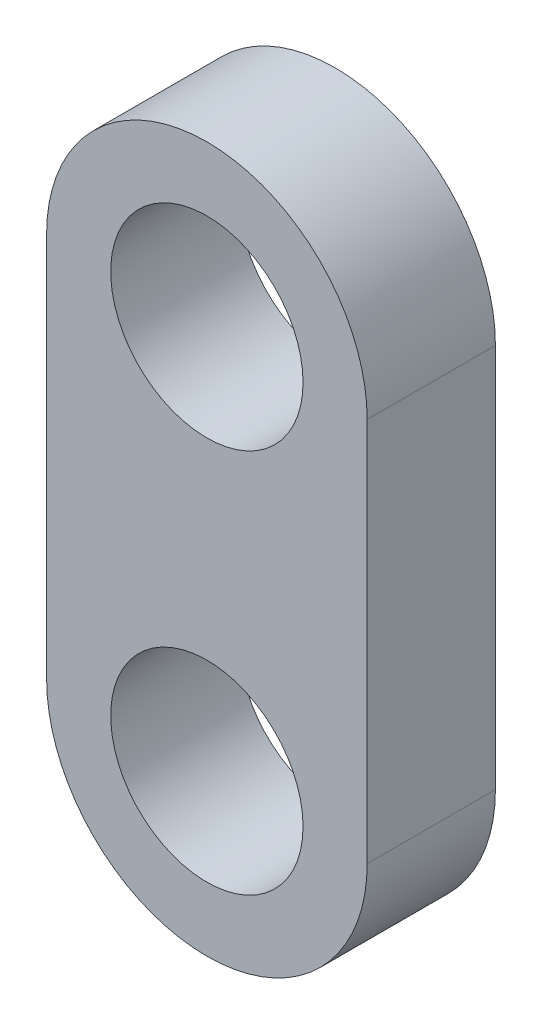
ISO-10303-21;
HEADER;
FILE_DESCRIPTION(('STEP AP214'),'2;1');
FILE_NAME('part.step','',(''),(''),'','','');
FILE_SCHEMA(('AUTOMOTIVE_DESIGN { 1 0 10303 214 1 1 1 1 }'));
ENDSEC;
DATA;
#1=APPLICATION_CONTEXT('core data for automotive mechanical design processes');
#2=APPLICATION_PROTOCOL_DEFINITION('international standard','automotive_design',2000,#1);
#3=PRODUCT_CONTEXT('',#1,'mechanical');
#4=PRODUCT('Part','Part','',(#3));
#5=PRODUCT_RELATED_PRODUCT_CATEGORY('part','',(#4));
#6=PRODUCT_DEFINITION_FORMATION('','',#4);
#7=PRODUCT_DEFINITION_CONTEXT('part definition',#1,'design');
#8=PRODUCT_DEFINITION('design','',#6,#7);
#9=PRODUCT_DEFINITION_SHAPE('','',#8);
#10=(LENGTH_UNIT() NAMED_UNIT(*) SI_UNIT(.MILLI.,.METRE.));
#11=(NAMED_UNIT(*) PLANE_ANGLE_UNIT() SI_UNIT($,.RADIAN.));
#12=(NAMED_UNIT(*) SI_UNIT($,.STERADIAN.) SOLID_ANGLE_UNIT());
#13=UNCERTAINTY_MEASURE_WITH_UNIT(LENGTH_MEASURE(1.E-05),#10,'distance_accuracy_value','');
#14=(GEOMETRIC_REPRESENTATION_CONTEXT(3) GLOBAL_UNCERTAINTY_ASSIGNED_CONTEXT((#13)) GLOBAL_UNIT_ASSIGNED_CONTEXT((#10,
#11,#12)) REPRESENTATION_CONTEXT('',''));
#15=CARTESIAN_POINT('',(0.,0.,0.));
#16=DIRECTION('',(0.,0.,1.));
#17=DIRECTION('',(1.,0.,0.));
#18=AXIS2_PLACEMENT_3D('',#15,#16,#17);
#19=CARTESIAN_POINT('',(0.,-15.,10.));
#20=DIRECTION('',(0.,0.,1.));
#21=DIRECTION('',(1.,0.,0.));
#22=AXIS2_PLACEMENT_3D('',#19,#20,#21);
#23=PLANE('',#22);
#24=CARTESIAN_POINT('',(0.,15.,10.));
#25=DIRECTION('',(0.,0.,1.));
#26=DIRECTION('',(1.,0.,0.));
#27=AXIS2_PLACEMENT_3D('',#24,#25,#26);
#28=CIRCLE('',#27,7.5);
#29=CARTESIAN_POINT('',(7.5,15.,10.));
#30=VERTEX_POINT('',#29);
#31=EDGE_CURVE('E99',#30,#30,#28,.T.);
#32=ORIENTED_EDGE('',*,*,#31,.F.);
#33=EDGE_LOOP('',(#32));
#34=FACE_BOUND('',#33,.T.);
#35=CARTESIAN_POINT('',(0.,-15.,10.));
#36=DIRECTION('',(0.,0.,1.));
#37=DIRECTION('',(1.,0.,0.));
#38=AXIS2_PLACEMENT_3D('',#35,#36,#37);
#39=CIRCLE('',#38,12.5);
#40=CARTESIAN_POINT('',(-12.5,-15.,10.));
#41=VERTEX_POINT('',#40);
#42=CARTESIAN_POINT('',(12.5,-15.,10.));
#43=VERTEX_POINT('',#42);
#44=EDGE_CURVE('E84',#41,#43,#39,.T.);
#45=ORIENTED_EDGE('',*,*,#44,.T.);
#46=DIRECTION('',(0.,1.,0.));
#47=VECTOR('',#46,1.);
#48=CARTESIAN_POINT('',(12.5,-15.,10.));
#49=LINE('',#48,#47);
#50=CARTESIAN_POINT('',(12.5,15.,10.));
#51=VERTEX_POINT('',#50);
#52=EDGE_CURVE('E79',#43,#51,#49,.T.);
#53=ORIENTED_EDGE('',*,*,#52,.T.);
#54=CARTESIAN_POINT('',(0.,15.,10.));
#55=DIRECTION('',(0.,0.,1.));
#56=DIRECTION('',(1.,0.,0.));
#57=AXIS2_PLACEMENT_3D('',#54,#55,#56);
#58=CIRCLE('',#57,12.5);
#59=CARTESIAN_POINT('',(-12.5,15.,10.));
#60=VERTEX_POINT('',#59);
#61=EDGE_CURVE('E82',#51,#60,#58,.T.);
#62=ORIENTED_EDGE('',*,*,#61,.T.);
#63=DIRECTION('',(0.,-1.,0.));
#64=VECTOR('',#63,1.);
#65=CARTESIAN_POINT('',(-12.5,-15.,10.));
#66=LINE('',#65,#64);
#67=EDGE_CURVE('E49',#60,#41,#66,.T.);
#68=ORIENTED_EDGE('',*,*,#67,.T.);
#69=EDGE_LOOP('',(#45,#53,#62,#68));
#70=FACE_BOUND('',#69,.T.);
#71=CARTESIAN_POINT('',(0.,-15.,10.));
#72=DIRECTION('',(0.,0.,1.));
#73=DIRECTION('',(1.,0.,0.));
#74=AXIS2_PLACEMENT_3D('',#71,#72,#73);
#75=CIRCLE('',#74,7.5);
#76=CARTESIAN_POINT('',(7.49999999999999,-15.,10.));
#77=VERTEX_POINT('',#76);
#78=EDGE_CURVE('E114',#77,#77,#75,.T.);
#79=ORIENTED_EDGE('',*,*,#78,.F.);
#80=EDGE_LOOP('',(#79));
#81=FACE_BOUND('',#80,.T.);
#82=ADVANCED_FACE('F32',(#34,#70,#81),#23,.T.);
#83=CARTESIAN_POINT('',(0.,-15.,0.));
#84=DIRECTION('',(0.,0.,1.));
#85=DIRECTION('',(1.,0.,0.));
#86=AXIS2_PLACEMENT_3D('',#83,#84,#85);
#87=PLANE('',#86);
#88=CARTESIAN_POINT('',(0.,15.,0.));
#89=DIRECTION('',(0.,0.,1.));
#90=DIRECTION('',(1.,0.,0.));
#91=AXIS2_PLACEMENT_3D('',#88,#89,#90);
#92=CIRCLE('',#91,7.5);
#93=CARTESIAN_POINT('',(7.5,15.,0.));
#94=VERTEX_POINT('',#93);
#95=EDGE_CURVE('E111',#94,#94,#92,.T.);
#96=ORIENTED_EDGE('',*,*,#95,.T.);
#97=EDGE_LOOP('',(#96));
#98=FACE_BOUND('',#97,.T.);
#99=CARTESIAN_POINT('',(0.,-15.,0.));
#100=DIRECTION('',(0.,0.,1.));
#101=DIRECTION('',(1.,0.,0.));
#102=AXIS2_PLACEMENT_3D('',#99,#100,#101);
#103=CIRCLE('',#102,12.5);
#104=CARTESIAN_POINT('',(-12.5,-15.,0.));
#105=VERTEX_POINT('',#104);
#106=CARTESIAN_POINT('',(12.5,-15.,0.));
#107=VERTEX_POINT('',#106);
#108=EDGE_CURVE('E96',#105,#107,#103,.T.);
#109=ORIENTED_EDGE('',*,*,#108,.F.);
#110=DIRECTION('',(0.,-1.,0.));
#111=VECTOR('',#110,1.);
#112=CARTESIAN_POINT('',(-12.5,-15.,0.));
#113=LINE('',#112,#111);
#114=CARTESIAN_POINT('',(-12.5,15.,0.));
#115=VERTEX_POINT('',#114);
#116=EDGE_CURVE('E72',#115,#105,#113,.T.);
#117=ORIENTED_EDGE('',*,*,#116,.F.);
#118=CARTESIAN_POINT('',(0.,15.,0.));
#119=DIRECTION('',(0.,0.,1.));
#120=DIRECTION('',(1.,0.,0.));
#121=AXIS2_PLACEMENT_3D('',#118,#119,#120);
#122=CIRCLE('',#121,12.5);
#123=CARTESIAN_POINT('',(12.5,15.,0.));
#124=VERTEX_POINT('',#123);
#125=EDGE_CURVE('E66',#124,#115,#122,.T.);
#126=ORIENTED_EDGE('',*,*,#125,.F.);
#127=DIRECTION('',(0.,1.,0.));
#128=VECTOR('',#127,1.);
#129=CARTESIAN_POINT('',(12.5,-15.,0.));
#130=LINE('',#129,#128);
#131=EDGE_CURVE('E88',#107,#124,#130,.T.);
#132=ORIENTED_EDGE('',*,*,#131,.F.);
#133=EDGE_LOOP('',(#109,#117,#126,#132));
#134=FACE_BOUND('',#133,.T.);
#135=CARTESIAN_POINT('',(0.,-15.,0.));
#136=DIRECTION('',(0.,0.,1.));
#137=DIRECTION('',(1.,0.,0.));
#138=AXIS2_PLACEMENT_3D('',#135,#136,#137);
#139=CIRCLE('',#138,7.5);
#140=CARTESIAN_POINT('',(7.49999999999999,-15.,0.));
#141=VERTEX_POINT('',#140);
#142=EDGE_CURVE('E117',#141,#141,#139,.T.);
#143=ORIENTED_EDGE('',*,*,#142,.T.);
#144=EDGE_LOOP('',(#143));
#145=FACE_BOUND('',#144,.T.);
#146=ADVANCED_FACE('F107',(#98,#134,#145),#87,.F.);
#147=CARTESIAN_POINT('',(0.,-15.,10.));
#148=DIRECTION('',(0.,0.,-1.));
#149=DIRECTION('',(-1.,0.,0.));
#150=AXIS2_PLACEMENT_3D('',#147,#148,#149);
#151=CYLINDRICAL_SURFACE('',#150,12.5);
#152=ORIENTED_EDGE('',*,*,#108,.T.);
#153=DIRECTION('',(0.,0.,-1.));
#154=VECTOR('',#153,1.);
#155=CARTESIAN_POINT('',(12.5,-15.,10.));
#156=LINE('',#155,#154);
#157=EDGE_CURVE('E11',#43,#107,#156,.T.);
#158=ORIENTED_EDGE('',*,*,#157,.F.);
#159=ORIENTED_EDGE('',*,*,#44,.F.);
#160=DIRECTION('',(0.,0.,-1.));
#161=VECTOR('',#160,1.);
#162=CARTESIAN_POINT('',(-12.5,-15.,10.));
#163=LINE('',#162,#161);
#164=EDGE_CURVE('E92',#41,#105,#163,.T.);
#165=ORIENTED_EDGE('',*,*,#164,.T.);
#166=EDGE_LOOP('',(#152,#158,#159,#165));
#167=FACE_BOUND('',#166,.T.);
#168=ADVANCED_FACE('F34',(#167),#151,.T.);
#169=CARTESIAN_POINT('',(12.5,-15.,10.));
#170=DIRECTION('',(-1.,0.,0.));
#171=DIRECTION('',(0.,-1.,0.));
#172=AXIS2_PLACEMENT_3D('',#169,#170,#171);
#173=PLANE('',#172);
#174=ORIENTED_EDGE('',*,*,#131,.T.);
#175=DIRECTION('',(0.,0.,-1.));
#176=VECTOR('',#175,1.);
#177=CARTESIAN_POINT('',(12.5,15.,10.));
#178=LINE('',#177,#176);
#179=EDGE_CURVE('E41',#51,#124,#178,.T.);
#180=ORIENTED_EDGE('',*,*,#179,.F.);
#181=ORIENTED_EDGE('',*,*,#52,.F.);
#182=ORIENTED_EDGE('',*,*,#157,.T.);
#183=EDGE_LOOP('',(#174,#180,#181,#182));
#184=FACE_BOUND('',#183,.T.);
#185=ADVANCED_FACE('F87',(#184),#173,.F.);
#186=CARTESIAN_POINT('',(0.,15.,10.));
#187=DIRECTION('',(0.,0.,-1.));
#188=DIRECTION('',(-1.,0.,0.));
#189=AXIS2_PLACEMENT_3D('',#186,#187,#188);
#190=CYLINDRICAL_SURFACE('',#189,12.5);
#191=ORIENTED_EDGE('',*,*,#125,.T.);
#192=DIRECTION('',(0.,0.,-1.));
#193=VECTOR('',#192,1.);
#194=CARTESIAN_POINT('',(-12.5,15.,10.));
#195=LINE('',#194,#193);
#196=EDGE_CURVE('E89',#60,#115,#195,.T.);
#197=ORIENTED_EDGE('',*,*,#196,.F.);
#198=ORIENTED_EDGE('',*,*,#61,.F.);
#199=ORIENTED_EDGE('',*,*,#179,.T.);
#200=EDGE_LOOP('',(#191,#197,#198,#199));
#201=FACE_BOUND('',#200,.T.);
#202=ADVANCED_FACE('F90',(#201),#190,.T.);
#203=CARTESIAN_POINT('',(-12.5,-15.,10.));
#204=DIRECTION('',(1.,0.,0.));
#205=DIRECTION('',(0.,1.,0.));
#206=AXIS2_PLACEMENT_3D('',#203,#204,#205);
#207=PLANE('',#206);
#208=ORIENTED_EDGE('',*,*,#116,.T.);
#209=ORIENTED_EDGE('',*,*,#164,.F.);
#210=ORIENTED_EDGE('',*,*,#67,.F.);
#211=ORIENTED_EDGE('',*,*,#196,.T.);
#212=EDGE_LOOP('',(#208,#209,#210,#211));
#213=FACE_BOUND('',#212,.T.);
#214=ADVANCED_FACE('F104',(#213),#207,.F.);
#215=CARTESIAN_POINT('',(0.,15.,10.));
#216=DIRECTION('',(0.,0.,-1.));
#217=DIRECTION('',(-1.,0.,0.));
#218=AXIS2_PLACEMENT_3D('',#215,#216,#217);
#219=CYLINDRICAL_SURFACE('',#218,7.5);
#220=ORIENTED_EDGE('',*,*,#31,.T.);
#221=EDGE_LOOP('',(#220));
#222=FACE_BOUND('',#221,.T.);
#223=ORIENTED_EDGE('',*,*,#95,.F.);
#224=EDGE_LOOP('',(#223));
#225=FACE_BOUND('',#224,.T.);
#226=ADVANCED_FACE('F135',(#222,#225),#219,.F.);
#227=CARTESIAN_POINT('',(0.,-15.,10.));
#228=DIRECTION('',(0.,0.,-1.));
#229=DIRECTION('',(-1.,0.,0.));
#230=AXIS2_PLACEMENT_3D('',#227,#228,#229);
#231=CYLINDRICAL_SURFACE('',#230,7.5);
#232=ORIENTED_EDGE('',*,*,#78,.T.);
#233=EDGE_LOOP('',(#232));
#234=FACE_BOUND('',#233,.T.);
#235=ORIENTED_EDGE('',*,*,#142,.F.);
#236=EDGE_LOOP('',(#235));
#237=FACE_BOUND('',#236,.T.);
#238=ADVANCED_FACE('F123',(#234,#237),#231,.F.);
#239=CLOSED_SHELL('',(#82,#146,#168,#185,#202,#214,#226,#238));
#240=MANIFOLD_SOLID_BREP('B2',#239);
#241=ADVANCED_BREP_SHAPE_REPRESENTATION('',(#18,#240),#14);
#242=SHAPE_DEFINITION_REPRESENTATION(#9,#241);
ENDSEC;
END-ISO-10303-21;
